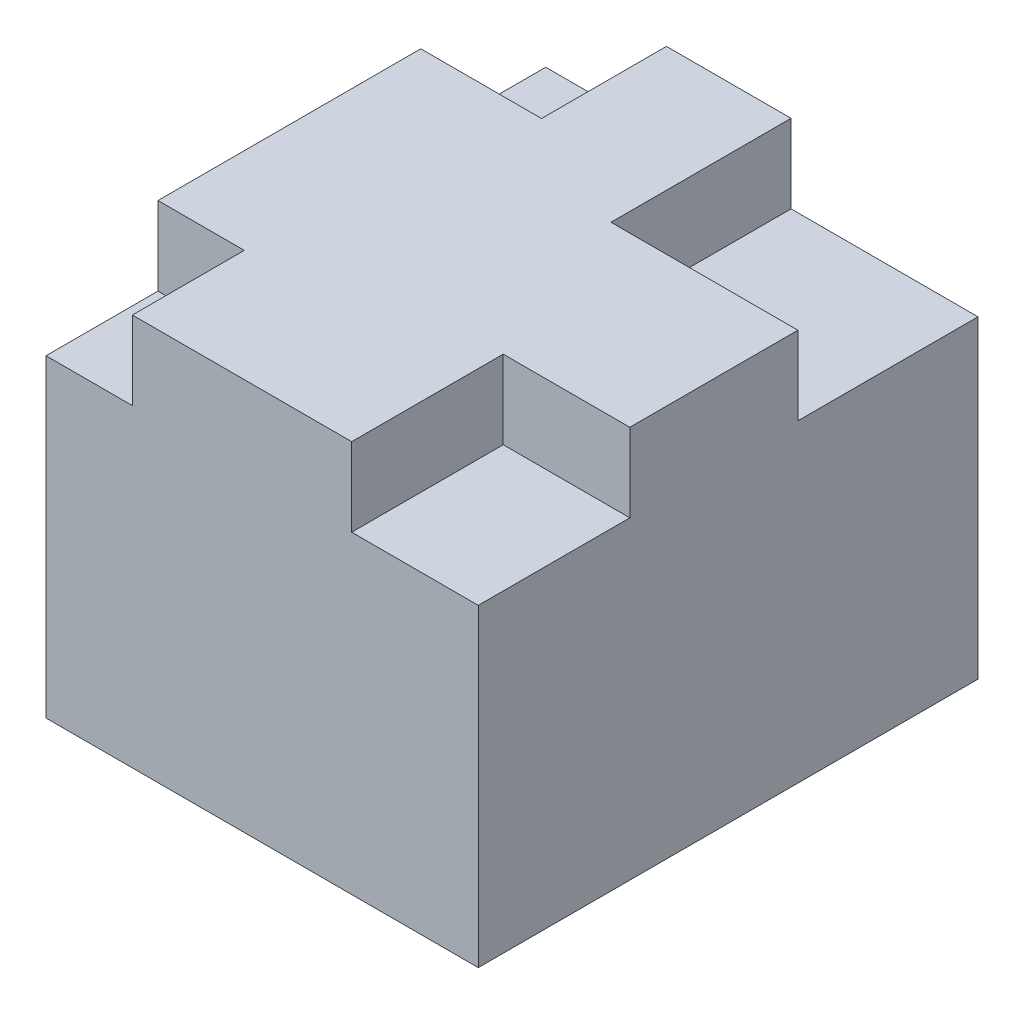
ISO-10303-21;
HEADER;
FILE_DESCRIPTION(('STEP AP214'),'2;1');
FILE_NAME('part.step','',(''),(''),'','','');
FILE_SCHEMA(('AUTOMOTIVE_DESIGN { 1 0 10303 214 1 1 1 1 }'));
ENDSEC;
DATA;
#1=APPLICATION_CONTEXT('core data for automotive mechanical design processes');
#2=APPLICATION_PROTOCOL_DEFINITION('international standard','automotive_design',2000,#1);
#3=PRODUCT_CONTEXT('',#1,'mechanical');
#4=PRODUCT('Part','Part','',(#3));
#5=PRODUCT_RELATED_PRODUCT_CATEGORY('part','',(#4));
#6=PRODUCT_DEFINITION_FORMATION('','',#4);
#7=PRODUCT_DEFINITION_CONTEXT('part definition',#1,'design');
#8=PRODUCT_DEFINITION('design','',#6,#7);
#9=PRODUCT_DEFINITION_SHAPE('','',#8);
#10=(LENGTH_UNIT() NAMED_UNIT(*) SI_UNIT(.MILLI.,.METRE.));
#11=(NAMED_UNIT(*) PLANE_ANGLE_UNIT() SI_UNIT($,.RADIAN.));
#12=(NAMED_UNIT(*) SI_UNIT($,.STERADIAN.) SOLID_ANGLE_UNIT());
#13=UNCERTAINTY_MEASURE_WITH_UNIT(LENGTH_MEASURE(1.E-05),#10,'distance_accuracy_value','');
#14=(GEOMETRIC_REPRESENTATION_CONTEXT(3) GLOBAL_UNCERTAINTY_ASSIGNED_CONTEXT((#13)) GLOBAL_UNIT_ASSIGNED_CONTEXT((#10,
#11,#12)) REPRESENTATION_CONTEXT('',''));
#15=CARTESIAN_POINT('',(0.,0.,0.));
#16=DIRECTION('',(0.,0.,1.));
#17=DIRECTION('',(1.,0.,0.));
#18=AXIS2_PLACEMENT_3D('',#15,#16,#17);
#19=CARTESIAN_POINT('',(-5.51061705069056,10.,6.37022815328691));
#20=DIRECTION('',(1.,0.,0.));
#21=DIRECTION('',(0.,0.,-1.));
#22=AXIS2_PLACEMENT_3D('',#19,#20,#21);
#23=PLANE('',#22);
#24=DIRECTION('',(0.,0.,1.));
#25=VECTOR('',#24,1.);
#26=CARTESIAN_POINT('',(-5.51061705069056,10.,6.37022815328691));
#27=LINE('',#26,#25);
#28=CARTESIAN_POINT('',(-5.51061705069056,10.,-3.18491757084579));
#29=VERTEX_POINT('',#28);
#30=CARTESIAN_POINT('',(-5.51061705069056,10.,3.51581809768684));
#31=VERTEX_POINT('',#30);
#32=EDGE_CURVE('E300',#29,#31,#27,.T.);
#33=ORIENTED_EDGE('',*,*,#32,.F.);
#34=DIRECTION('',(0.,1.,0.));
#35=VECTOR('',#34,1.);
#36=CARTESIAN_POINT('',(-5.51061705069056,8.,-3.1849175708458));
#37=LINE('',#36,#35);
#38=CARTESIAN_POINT('',(-5.51061705069056,8.,-3.1849175708458));
#39=VERTEX_POINT('',#38);
#40=EDGE_CURVE('E241',#39,#29,#37,.T.);
#41=ORIENTED_EDGE('',*,*,#40,.F.);
#42=DIRECTION('',(0.,0.,1.));
#43=VECTOR('',#42,1.);
#44=CARTESIAN_POINT('',(-5.51061705069056,8.,-6.37022815328691));
#45=LINE('',#44,#43);
#46=CARTESIAN_POINT('',(-5.51061705069056,8.,-6.37022815328691));
#47=VERTEX_POINT('',#46);
#48=EDGE_CURVE('E229',#47,#39,#45,.T.);
#49=ORIENTED_EDGE('',*,*,#48,.F.);
#50=DIRECTION('',(0.,-1.,0.));
#51=VECTOR('',#50,1.);
#52=CARTESIAN_POINT('',(-5.51061705069056,10.,-6.37022815328691));
#53=LINE('',#52,#51);
#54=CARTESIAN_POINT('',(-5.51061705069056,0.,-6.37022815328691));
#55=VERTEX_POINT('',#54);
#56=EDGE_CURVE('E311',#47,#55,#53,.T.);
#57=ORIENTED_EDGE('',*,*,#56,.T.);
#58=DIRECTION('',(0.,0.,1.));
#59=VECTOR('',#58,1.);
#60=CARTESIAN_POINT('',(-5.51061705069056,0.,6.37022815328691));
#61=LINE('',#60,#59);
#62=CARTESIAN_POINT('',(-5.51061705069056,0.,6.37022815328691));
#63=VERTEX_POINT('',#62);
#64=EDGE_CURVE('E296',#55,#63,#61,.T.);
#65=ORIENTED_EDGE('',*,*,#64,.T.);
#66=DIRECTION('',(0.,-1.,0.));
#67=VECTOR('',#66,1.);
#68=CARTESIAN_POINT('',(-5.51061705069056,10.,6.37022815328691));
#69=LINE('',#68,#67);
#70=CARTESIAN_POINT('',(-5.51061705069056,8.,6.37022815328691));
#71=VERTEX_POINT('',#70);
#72=EDGE_CURVE('E11',#71,#63,#69,.T.);
#73=ORIENTED_EDGE('',*,*,#72,.F.);
#74=DIRECTION('',(0.,0.,1.));
#75=VECTOR('',#74,1.);
#76=CARTESIAN_POINT('',(-5.51061705069056,8.,6.37022815328691));
#77=LINE('',#76,#75);
#78=CARTESIAN_POINT('',(-5.51061705069056,8.,3.51581809768684));
#79=VERTEX_POINT('',#78);
#80=EDGE_CURVE('E276',#79,#71,#77,.T.);
#81=ORIENTED_EDGE('',*,*,#80,.F.);
#82=DIRECTION('',(0.,1.,0.));
#83=VECTOR('',#82,1.);
#84=CARTESIAN_POINT('',(-5.51061705069056,8.,3.51581809768684));
#85=LINE('',#84,#83);
#86=EDGE_CURVE('E293',#79,#31,#85,.T.);
#87=ORIENTED_EDGE('',*,*,#86,.T.);
#88=EDGE_LOOP('',(#33,#41,#49,#57,#65,#73,#81,#87));
#89=FACE_BOUND('',#88,.T.);
#90=ADVANCED_FACE('F33',(#89),#23,.F.);
#91=CARTESIAN_POINT('',(5.51061705069055,10.,6.37022815328691));
#92=DIRECTION('',(0.,0.,-1.));
#93=DIRECTION('',(-1.,0.,0.));
#94=AXIS2_PLACEMENT_3D('',#91,#92,#93);
#95=PLANE('',#94);
#96=DIRECTION('',(1.,0.,0.));
#97=VECTOR('',#96,1.);
#98=CARTESIAN_POINT('',(5.51061705069055,8.,6.37022815328691));
#99=LINE('',#98,#97);
#100=CARTESIAN_POINT('',(2.28321363520371,8.,6.37022815328691));
#101=VERTEX_POINT('',#100);
#102=CARTESIAN_POINT('',(5.51061705069055,8.,6.37022815328691));
#103=VERTEX_POINT('',#102);
#104=EDGE_CURVE('E263',#101,#103,#99,.T.);
#105=ORIENTED_EDGE('',*,*,#104,.F.);
#106=DIRECTION('',(0.,1.,0.));
#107=VECTOR('',#106,1.);
#108=CARTESIAN_POINT('',(2.28321363520371,8.,6.37022815328691));
#109=LINE('',#108,#107);
#110=CARTESIAN_POINT('',(2.28321363520371,10.,6.37022815328691));
#111=VERTEX_POINT('',#110);
#112=EDGE_CURVE('E269',#101,#111,#109,.T.);
#113=ORIENTED_EDGE('',*,*,#112,.T.);
#114=DIRECTION('',(1.,0.,0.));
#115=VECTOR('',#114,1.);
#116=CARTESIAN_POINT('',(5.51061705069055,10.,6.37022815328691));
#117=LINE('',#116,#115);
#118=CARTESIAN_POINT('',(-3.30900526841118,10.,6.37022815328691));
#119=VERTEX_POINT('',#118);
#120=EDGE_CURVE('E302',#119,#111,#117,.T.);
#121=ORIENTED_EDGE('',*,*,#120,.F.);
#122=DIRECTION('',(0.,1.,0.));
#123=VECTOR('',#122,1.);
#124=CARTESIAN_POINT('',(-3.30900526841118,8.,6.37022815328691));
#125=LINE('',#124,#123);
#126=CARTESIAN_POINT('',(-3.30900526841118,8.,6.37022815328691));
#127=VERTEX_POINT('',#126);
#128=EDGE_CURVE('E288',#127,#119,#125,.T.);
#129=ORIENTED_EDGE('',*,*,#128,.F.);
#130=DIRECTION('',(1.,0.,0.));
#131=VECTOR('',#130,1.);
#132=CARTESIAN_POINT('',(-5.51061705069056,8.,6.37022815328691));
#133=LINE('',#132,#131);
#134=EDGE_CURVE('E278',#71,#127,#133,.T.);
#135=ORIENTED_EDGE('',*,*,#134,.F.);
#136=ORIENTED_EDGE('',*,*,#72,.T.);
#137=DIRECTION('',(1.,0.,0.));
#138=VECTOR('',#137,1.);
#139=CARTESIAN_POINT('',(5.51061705069055,0.,6.37022815328691));
#140=LINE('',#139,#138);
#141=CARTESIAN_POINT('',(5.51061705069055,0.,6.37022815328691));
#142=VERTEX_POINT('',#141);
#143=EDGE_CURVE('E314',#63,#142,#140,.T.);
#144=ORIENTED_EDGE('',*,*,#143,.T.);
#145=DIRECTION('',(0.,-1.,0.));
#146=VECTOR('',#145,1.);
#147=CARTESIAN_POINT('',(5.51061705069055,10.,6.37022815328691));
#148=LINE('',#147,#146);
#149=EDGE_CURVE('E40',#103,#142,#148,.T.);
#150=ORIENTED_EDGE('',*,*,#149,.F.);
#151=EDGE_LOOP('',(#105,#113,#121,#129,#135,#136,#144,#150));
#152=FACE_BOUND('',#151,.T.);
#153=ADVANCED_FACE('F336',(#152),#95,.F.);
#154=CARTESIAN_POINT('',(5.51061705069055,10.,6.37022815328691));
#155=DIRECTION('',(-1.,0.,0.));
#156=DIRECTION('',(0.,0.,1.));
#157=AXIS2_PLACEMENT_3D('',#154,#155,#156);
#158=PLANE('',#157);
#159=DIRECTION('',(0.,0.,-1.));
#160=VECTOR('',#159,1.);
#161=CARTESIAN_POINT('',(5.51061705069055,8.,-6.37022815328691));
#162=LINE('',#161,#160);
#163=CARTESIAN_POINT('',(5.51061705069055,8.,-1.77859033177104));
#164=VERTEX_POINT('',#163);
#165=CARTESIAN_POINT('',(5.51061705069055,8.,-6.37022815328691));
#166=VERTEX_POINT('',#165);
#167=EDGE_CURVE('E208',#164,#166,#162,.T.);
#168=ORIENTED_EDGE('',*,*,#167,.F.);
#169=DIRECTION('',(0.,1.,0.));
#170=VECTOR('',#169,1.);
#171=CARTESIAN_POINT('',(5.51061705069055,8.,-1.77859033177104));
#172=LINE('',#171,#170);
#173=CARTESIAN_POINT('',(5.51061705069055,10.,-1.77859033177104));
#174=VERTEX_POINT('',#173);
#175=EDGE_CURVE('E222',#164,#174,#172,.T.);
#176=ORIENTED_EDGE('',*,*,#175,.T.);
#177=DIRECTION('',(0.,0.,-1.));
#178=VECTOR('',#177,1.);
#179=CARTESIAN_POINT('',(5.51061705069055,10.,6.37022815328691));
#180=LINE('',#179,#178);
#181=CARTESIAN_POINT('',(5.51061705069055,10.,2.50657149082143));
#182=VERTEX_POINT('',#181);
#183=EDGE_CURVE('E306',#182,#174,#180,.T.);
#184=ORIENTED_EDGE('',*,*,#183,.F.);
#185=DIRECTION('',(0.,1.,0.));
#186=VECTOR('',#185,1.);
#187=CARTESIAN_POINT('',(5.51061705069055,8.,2.50657149082143));
#188=LINE('',#187,#186);
#189=CARTESIAN_POINT('',(5.51061705069055,8.,2.50657149082143));
#190=VERTEX_POINT('',#189);
#191=EDGE_CURVE('E265',#190,#182,#188,.T.);
#192=ORIENTED_EDGE('',*,*,#191,.F.);
#193=DIRECTION('',(0.,0.,-1.));
#194=VECTOR('',#193,1.);
#195=CARTESIAN_POINT('',(5.51061705069055,8.,6.37022815328691));
#196=LINE('',#195,#194);
#197=EDGE_CURVE('E253',#103,#190,#196,.T.);
#198=ORIENTED_EDGE('',*,*,#197,.F.);
#199=ORIENTED_EDGE('',*,*,#149,.T.);
#200=DIRECTION('',(0.,0.,-1.));
#201=VECTOR('',#200,1.);
#202=CARTESIAN_POINT('',(5.51061705069055,0.,6.37022815328691));
#203=LINE('',#202,#201);
#204=CARTESIAN_POINT('',(5.51061705069055,0.,-6.37022815328691));
#205=VERTEX_POINT('',#204);
#206=EDGE_CURVE('E317',#142,#205,#203,.T.);
#207=ORIENTED_EDGE('',*,*,#206,.T.);
#208=DIRECTION('',(0.,-1.,0.));
#209=VECTOR('',#208,1.);
#210=CARTESIAN_POINT('',(5.51061705069055,10.,-6.37022815328691));
#211=LINE('',#210,#209);
#212=EDGE_CURVE('E323',#166,#205,#211,.T.);
#213=ORIENTED_EDGE('',*,*,#212,.F.);
#214=EDGE_LOOP('',(#168,#176,#184,#192,#198,#199,#207,#213));
#215=FACE_BOUND('',#214,.T.);
#216=ADVANCED_FACE('F328',(#215),#158,.F.);
#217=CARTESIAN_POINT('',(5.51061705069055,10.,-6.37022815328691));
#218=DIRECTION('',(0.,0.,1.));
#219=DIRECTION('',(1.,0.,0.));
#220=AXIS2_PLACEMENT_3D('',#217,#218,#219);
#221=PLANE('',#220);
#222=DIRECTION('',(-1.,0.,0.));
#223=VECTOR('',#222,1.);
#224=CARTESIAN_POINT('',(5.51061705069055,10.,-6.37022815328691));
#225=LINE('',#224,#223);
#226=CARTESIAN_POINT('',(0.744526185392516,10.,-6.37022815328691));
#227=VERTEX_POINT('',#226);
#228=CARTESIAN_POINT('',(-2.43211887228222,10.,-6.37022815328691));
#229=VERTEX_POINT('',#228);
#230=EDGE_CURVE('E309',#227,#229,#225,.T.);
#231=ORIENTED_EDGE('',*,*,#230,.F.);
#232=DIRECTION('',(0.,1.,0.));
#233=VECTOR('',#232,1.);
#234=CARTESIAN_POINT('',(0.744526185392516,8.,-6.37022815328691));
#235=LINE('',#234,#233);
#236=CARTESIAN_POINT('',(0.744526185392516,8.,-6.37022815328691));
#237=VERTEX_POINT('',#236);
#238=EDGE_CURVE('E55',#237,#227,#235,.T.);
#239=ORIENTED_EDGE('',*,*,#238,.F.);
#240=DIRECTION('',(-1.,0.,0.));
#241=VECTOR('',#240,1.);
#242=CARTESIAN_POINT('',(5.51061705069055,8.,-6.37022815328691));
#243=LINE('',#242,#241);
#244=EDGE_CURVE('E210',#166,#237,#243,.T.);
#245=ORIENTED_EDGE('',*,*,#244,.F.);
#246=ORIENTED_EDGE('',*,*,#212,.T.);
#247=DIRECTION('',(-1.,0.,0.));
#248=VECTOR('',#247,1.);
#249=CARTESIAN_POINT('',(5.51061705069055,0.,-6.37022815328691));
#250=LINE('',#249,#248);
#251=EDGE_CURVE('E303',#205,#55,#250,.T.);
#252=ORIENTED_EDGE('',*,*,#251,.T.);
#253=ORIENTED_EDGE('',*,*,#56,.F.);
#254=DIRECTION('',(-1.,0.,0.));
#255=VECTOR('',#254,1.);
#256=CARTESIAN_POINT('',(-5.51061705069056,8.,-6.37022815328691));
#257=LINE('',#256,#255);
#258=CARTESIAN_POINT('',(-2.43211887228222,8.,-6.37022815328691));
#259=VERTEX_POINT('',#258);
#260=EDGE_CURVE('E239',#259,#47,#257,.T.);
#261=ORIENTED_EDGE('',*,*,#260,.F.);
#262=DIRECTION('',(0.,1.,0.));
#263=VECTOR('',#262,1.);
#264=CARTESIAN_POINT('',(-2.43211887228222,8.,-6.37022815328691));
#265=LINE('',#264,#263);
#266=EDGE_CURVE('E246',#259,#229,#265,.T.);
#267=ORIENTED_EDGE('',*,*,#266,.T.);
#268=EDGE_LOOP('',(#231,#239,#245,#246,#252,#253,#261,#267));
#269=FACE_BOUND('',#268,.T.);
#270=ADVANCED_FACE('F345',(#269),#221,.F.);
#271=CARTESIAN_POINT('',(0.,10.,0.));
#272=DIRECTION('',(0.,1.,0.));
#273=DIRECTION('',(0.,0.,1.));
#274=AXIS2_PLACEMENT_3D('',#271,#272,#273);
#275=PLANE('',#274);
#276=DIRECTION('',(1.,0.,0.));
#277=VECTOR('',#276,1.);
#278=CARTESIAN_POINT('',(5.51061705069055,10.,-1.77859033177104));
#279=LINE('',#278,#277);
#280=CARTESIAN_POINT('',(0.744526185392516,10.,-1.77859033177104));
#281=VERTEX_POINT('',#280);
#282=EDGE_CURVE('E211',#281,#174,#279,.T.);
#283=ORIENTED_EDGE('',*,*,#282,.F.);
#284=DIRECTION('',(0.,0.,1.));
#285=VECTOR('',#284,1.);
#286=CARTESIAN_POINT('',(0.744526185392516,10.,-6.37022815328691));
#287=LINE('',#286,#285);
#288=EDGE_CURVE('E204',#227,#281,#287,.T.);
#289=ORIENTED_EDGE('',*,*,#288,.F.);
#290=ORIENTED_EDGE('',*,*,#230,.T.);
#291=DIRECTION('',(0.,0.,-1.));
#292=VECTOR('',#291,1.);
#293=CARTESIAN_POINT('',(-2.43211887228222,10.,-6.37022815328691));
#294=LINE('',#293,#292);
#295=CARTESIAN_POINT('',(-2.43211887228222,10.,-3.1849175708458));
#296=VERTEX_POINT('',#295);
#297=EDGE_CURVE('E233',#296,#229,#294,.T.);
#298=ORIENTED_EDGE('',*,*,#297,.F.);
#299=DIRECTION('',(1.,0.,0.));
#300=VECTOR('',#299,1.);
#301=CARTESIAN_POINT('',(-5.51061705069056,10.,-3.1849175708458));
#302=LINE('',#301,#300);
#303=EDGE_CURVE('E225',#29,#296,#302,.T.);
#304=ORIENTED_EDGE('',*,*,#303,.F.);
#305=ORIENTED_EDGE('',*,*,#32,.T.);
#306=DIRECTION('',(-1.,0.,0.));
#307=VECTOR('',#306,1.);
#308=CARTESIAN_POINT('',(-5.51061705069056,10.,3.51581809768684));
#309=LINE('',#308,#307);
#310=CARTESIAN_POINT('',(-3.30900526841118,10.,3.51581809768684));
#311=VERTEX_POINT('',#310);
#312=EDGE_CURVE('E279',#311,#31,#309,.T.);
#313=ORIENTED_EDGE('',*,*,#312,.F.);
#314=DIRECTION('',(0.,0.,-1.));
#315=VECTOR('',#314,1.);
#316=CARTESIAN_POINT('',(-3.30900526841118,10.,6.37022815328691));
#317=LINE('',#316,#315);
#318=EDGE_CURVE('E272',#119,#311,#317,.T.);
#319=ORIENTED_EDGE('',*,*,#318,.F.);
#320=ORIENTED_EDGE('',*,*,#120,.T.);
#321=DIRECTION('',(0.,0.,1.));
#322=VECTOR('',#321,1.);
#323=CARTESIAN_POINT('',(2.28321363520371,10.,6.37022815328691));
#324=LINE('',#323,#322);
#325=CARTESIAN_POINT('',(2.28321363520371,10.,2.50657149082143));
#326=VERTEX_POINT('',#325);
#327=EDGE_CURVE('E257',#326,#111,#324,.T.);
#328=ORIENTED_EDGE('',*,*,#327,.F.);
#329=DIRECTION('',(-1.,0.,0.));
#330=VECTOR('',#329,1.);
#331=CARTESIAN_POINT('',(5.51061705069055,10.,2.50657149082143));
#332=LINE('',#331,#330);
#333=EDGE_CURVE('E249',#182,#326,#332,.T.);
#334=ORIENTED_EDGE('',*,*,#333,.F.);
#335=ORIENTED_EDGE('',*,*,#183,.T.);
#336=EDGE_LOOP('',(#283,#289,#290,#298,#304,#305,#313,#319,#320,#328,#334,#335));
#337=FACE_BOUND('',#336,.T.);
#338=ADVANCED_FACE('F356',(#337),#275,.T.);
#339=CARTESIAN_POINT('',(0.,0.,0.));
#340=DIRECTION('',(0.,1.,0.));
#341=DIRECTION('',(0.,0.,1.));
#342=AXIS2_PLACEMENT_3D('',#339,#340,#341);
#343=PLANE('',#342);
#344=DIRECTION('',(1.,0.,0.));
#345=VECTOR('',#344,1.);
#346=CARTESIAN_POINT('',(2.1012183454411,0.,-2.17567096398038));
#347=LINE('',#346,#345);
#348=CARTESIAN_POINT('',(-2.1012183454411,0.,-2.17567096398038));
#349=VERTEX_POINT('',#348);
#350=CARTESIAN_POINT('',(2.1012183454411,0.,-2.17567096398038));
#351=VERTEX_POINT('',#350);
#352=EDGE_CURVE('E198',#349,#351,#347,.T.);
#353=ORIENTED_EDGE('',*,*,#352,.F.);
#354=DIRECTION('',(0.,0.,-1.));
#355=VECTOR('',#354,1.);
#356=CARTESIAN_POINT('',(-2.1012183454411,0.,-2.17567096398038));
#357=LINE('',#356,#355);
#358=CARTESIAN_POINT('',(-2.1012183454411,0.,2.17567096398038));
#359=VERTEX_POINT('',#358);
#360=EDGE_CURVE('E47',#359,#349,#357,.T.);
#361=ORIENTED_EDGE('',*,*,#360,.F.);
#362=DIRECTION('',(-1.,0.,0.));
#363=VECTOR('',#362,1.);
#364=CARTESIAN_POINT('',(2.1012183454411,0.,2.17567096398038));
#365=LINE('',#364,#363);
#366=CARTESIAN_POINT('',(2.1012183454411,0.,2.17567096398038));
#367=VERTEX_POINT('',#366);
#368=EDGE_CURVE('E189',#367,#359,#365,.T.);
#369=ORIENTED_EDGE('',*,*,#368,.F.);
#370=DIRECTION('',(0.,0.,1.));
#371=VECTOR('',#370,1.);
#372=CARTESIAN_POINT('',(2.1012183454411,0.,-2.17567096398038));
#373=LINE('',#372,#371);
#374=EDGE_CURVE('E192',#351,#367,#373,.T.);
#375=ORIENTED_EDGE('',*,*,#374,.F.);
#376=EDGE_LOOP('',(#353,#361,#369,#375));
#377=FACE_BOUND('',#376,.T.);
#378=ORIENTED_EDGE('',*,*,#64,.F.);
#379=ORIENTED_EDGE('',*,*,#251,.F.);
#380=ORIENTED_EDGE('',*,*,#206,.F.);
#381=ORIENTED_EDGE('',*,*,#143,.F.);
#382=EDGE_LOOP('',(#378,#379,#380,#381));
#383=FACE_BOUND('',#382,.T.);
#384=ADVANCED_FACE('F341',(#377,#383),#343,.F.);
#385=CARTESIAN_POINT('',(-5.51061705069056,8.,3.51581809768684));
#386=DIRECTION('',(0.,0.,-1.));
#387=DIRECTION('',(-1.,0.,0.));
#388=AXIS2_PLACEMENT_3D('',#385,#386,#387);
#389=PLANE('',#388);
#390=ORIENTED_EDGE('',*,*,#312,.T.);
#391=ORIENTED_EDGE('',*,*,#86,.F.);
#392=DIRECTION('',(-1.,0.,0.));
#393=VECTOR('',#392,1.);
#394=CARTESIAN_POINT('',(-5.51061705069056,8.,3.51581809768684));
#395=LINE('',#394,#393);
#396=CARTESIAN_POINT('',(-3.30900526841118,8.,3.51581809768684));
#397=VERTEX_POINT('',#396);
#398=EDGE_CURVE('E285',#397,#79,#395,.T.);
#399=ORIENTED_EDGE('',*,*,#398,.F.);
#400=DIRECTION('',(0.,1.,0.));
#401=VECTOR('',#400,1.);
#402=CARTESIAN_POINT('',(-3.30900526841118,8.,3.51581809768684));
#403=LINE('',#402,#401);
#404=EDGE_CURVE('E297',#397,#311,#403,.T.);
#405=ORIENTED_EDGE('',*,*,#404,.T.);
#406=EDGE_LOOP('',(#390,#391,#399,#405));
#407=FACE_BOUND('',#406,.T.);
#408=ADVANCED_FACE('F387',(#407),#389,.F.);
#409=CARTESIAN_POINT('',(-3.30900526841118,8.,6.37022815328691));
#410=DIRECTION('',(1.,0.,0.));
#411=DIRECTION('',(0.,0.,-1.));
#412=AXIS2_PLACEMENT_3D('',#409,#410,#411);
#413=PLANE('',#412);
#414=ORIENTED_EDGE('',*,*,#318,.T.);
#415=ORIENTED_EDGE('',*,*,#404,.F.);
#416=DIRECTION('',(0.,0.,-1.));
#417=VECTOR('',#416,1.);
#418=CARTESIAN_POINT('',(-3.30900526841118,8.,6.37022815328691));
#419=LINE('',#418,#417);
#420=EDGE_CURVE('E282',#127,#397,#419,.T.);
#421=ORIENTED_EDGE('',*,*,#420,.F.);
#422=ORIENTED_EDGE('',*,*,#128,.T.);
#423=EDGE_LOOP('',(#414,#415,#421,#422));
#424=FACE_BOUND('',#423,.T.);
#425=ADVANCED_FACE('F370',(#424),#413,.F.);
#426=CARTESIAN_POINT('',(0.,8.,0.));
#427=DIRECTION('',(0.,-1.,0.));
#428=DIRECTION('',(0.,0.,-1.));
#429=AXIS2_PLACEMENT_3D('',#426,#427,#428);
#430=PLANE('',#429);
#431=ORIENTED_EDGE('',*,*,#80,.T.);
#432=ORIENTED_EDGE('',*,*,#134,.T.);
#433=ORIENTED_EDGE('',*,*,#420,.T.);
#434=ORIENTED_EDGE('',*,*,#398,.T.);
#435=EDGE_LOOP('',(#431,#432,#433,#434));
#436=FACE_BOUND('',#435,.T.);
#437=ADVANCED_FACE('F388',(#436),#430,.F.);
#438=CARTESIAN_POINT('',(2.28321363520371,8.,6.37022815328691));
#439=DIRECTION('',(-1.,0.,0.));
#440=DIRECTION('',(0.,0.,1.));
#441=AXIS2_PLACEMENT_3D('',#438,#439,#440);
#442=PLANE('',#441);
#443=ORIENTED_EDGE('',*,*,#327,.T.);
#444=ORIENTED_EDGE('',*,*,#112,.F.);
#445=DIRECTION('',(0.,0.,1.));
#446=VECTOR('',#445,1.);
#447=CARTESIAN_POINT('',(2.28321363520371,8.,6.37022815328691));
#448=LINE('',#447,#446);
#449=CARTESIAN_POINT('',(2.28321363520371,8.,2.50657149082143));
#450=VERTEX_POINT('',#449);
#451=EDGE_CURVE('E260',#450,#101,#448,.T.);
#452=ORIENTED_EDGE('',*,*,#451,.F.);
#453=DIRECTION('',(0.,1.,0.));
#454=VECTOR('',#453,1.);
#455=CARTESIAN_POINT('',(2.28321363520371,8.,2.50657149082143));
#456=LINE('',#455,#454);
#457=EDGE_CURVE('E273',#450,#326,#456,.T.);
#458=ORIENTED_EDGE('',*,*,#457,.T.);
#459=EDGE_LOOP('',(#443,#444,#452,#458));
#460=FACE_BOUND('',#459,.T.);
#461=ADVANCED_FACE('F390',(#460),#442,.F.);
#462=CARTESIAN_POINT('',(5.51061705069055,8.,2.50657149082143));
#463=DIRECTION('',(0.,0.,-1.));
#464=DIRECTION('',(-1.,0.,0.));
#465=AXIS2_PLACEMENT_3D('',#462,#463,#464);
#466=PLANE('',#465);
#467=ORIENTED_EDGE('',*,*,#333,.T.);
#468=ORIENTED_EDGE('',*,*,#457,.F.);
#469=DIRECTION('',(-1.,0.,0.));
#470=VECTOR('',#469,1.);
#471=CARTESIAN_POINT('',(5.51061705069055,8.,2.50657149082143));
#472=LINE('',#471,#470);
#473=EDGE_CURVE('E256',#190,#450,#472,.T.);
#474=ORIENTED_EDGE('',*,*,#473,.F.);
#475=ORIENTED_EDGE('',*,*,#191,.T.);
#476=EDGE_LOOP('',(#467,#468,#474,#475));
#477=FACE_BOUND('',#476,.T.);
#478=ADVANCED_FACE('F360',(#477),#466,.F.);
#479=CARTESIAN_POINT('',(0.,8.,0.));
#480=DIRECTION('',(0.,1.,0.));
#481=DIRECTION('',(0.,0.,1.));
#482=AXIS2_PLACEMENT_3D('',#479,#480,#481);
#483=PLANE('',#482);
#484=ORIENTED_EDGE('',*,*,#197,.T.);
#485=ORIENTED_EDGE('',*,*,#473,.T.);
#486=ORIENTED_EDGE('',*,*,#451,.T.);
#487=ORIENTED_EDGE('',*,*,#104,.T.);
#488=EDGE_LOOP('',(#484,#485,#486,#487));
#489=FACE_BOUND('',#488,.T.);
#490=ADVANCED_FACE('F363',(#489),#483,.T.);
#491=CARTESIAN_POINT('',(-2.43211887228222,8.,-6.37022815328691));
#492=DIRECTION('',(1.,0.,0.));
#493=DIRECTION('',(0.,0.,-1.));
#494=AXIS2_PLACEMENT_3D('',#491,#492,#493);
#495=PLANE('',#494);
#496=ORIENTED_EDGE('',*,*,#297,.T.);
#497=ORIENTED_EDGE('',*,*,#266,.F.);
#498=DIRECTION('',(0.,0.,-1.));
#499=VECTOR('',#498,1.);
#500=CARTESIAN_POINT('',(-2.43211887228222,8.,-6.37022815328691));
#501=LINE('',#500,#499);
#502=CARTESIAN_POINT('',(-2.43211887228222,8.,-3.1849175708458));
#503=VERTEX_POINT('',#502);
#504=EDGE_CURVE('E236',#503,#259,#501,.T.);
#505=ORIENTED_EDGE('',*,*,#504,.F.);
#506=DIRECTION('',(0.,1.,0.));
#507=VECTOR('',#506,1.);
#508=CARTESIAN_POINT('',(-2.43211887228222,8.,-3.1849175708458));
#509=LINE('',#508,#507);
#510=EDGE_CURVE('E250',#503,#296,#509,.T.);
#511=ORIENTED_EDGE('',*,*,#510,.T.);
#512=EDGE_LOOP('',(#496,#497,#505,#511));
#513=FACE_BOUND('',#512,.T.);
#514=ADVANCED_FACE('F381',(#513),#495,.F.);
#515=CARTESIAN_POINT('',(-5.51061705069056,8.,-3.1849175708458));
#516=DIRECTION('',(0.,0.,1.));
#517=DIRECTION('',(1.,0.,0.));
#518=AXIS2_PLACEMENT_3D('',#515,#516,#517);
#519=PLANE('',#518);
#520=ORIENTED_EDGE('',*,*,#303,.T.);
#521=ORIENTED_EDGE('',*,*,#510,.F.);
#522=DIRECTION('',(1.,0.,0.));
#523=VECTOR('',#522,1.);
#524=CARTESIAN_POINT('',(-5.51061705069056,8.,-3.1849175708458));
#525=LINE('',#524,#523);
#526=EDGE_CURVE('E232',#39,#503,#525,.T.);
#527=ORIENTED_EDGE('',*,*,#526,.F.);
#528=ORIENTED_EDGE('',*,*,#40,.T.);
#529=EDGE_LOOP('',(#520,#521,#527,#528));
#530=FACE_BOUND('',#529,.T.);
#531=ADVANCED_FACE('F459',(#530),#519,.F.);
#532=CARTESIAN_POINT('',(0.,8.,0.));
#533=DIRECTION('',(0.,1.,0.));
#534=DIRECTION('',(0.,0.,1.));
#535=AXIS2_PLACEMENT_3D('',#532,#533,#534);
#536=PLANE('',#535);
#537=ORIENTED_EDGE('',*,*,#48,.T.);
#538=ORIENTED_EDGE('',*,*,#526,.T.);
#539=ORIENTED_EDGE('',*,*,#504,.T.);
#540=ORIENTED_EDGE('',*,*,#260,.T.);
#541=EDGE_LOOP('',(#537,#538,#539,#540));
#542=FACE_BOUND('',#541,.T.);
#543=ADVANCED_FACE('F378',(#542),#536,.T.);
#544=CARTESIAN_POINT('',(5.51061705069055,8.,-1.77859033177104));
#545=DIRECTION('',(0.,0.,1.));
#546=DIRECTION('',(1.,0.,0.));
#547=AXIS2_PLACEMENT_3D('',#544,#545,#546);
#548=PLANE('',#547);
#549=ORIENTED_EDGE('',*,*,#282,.T.);
#550=ORIENTED_EDGE('',*,*,#175,.F.);
#551=DIRECTION('',(1.,0.,0.));
#552=VECTOR('',#551,1.);
#553=CARTESIAN_POINT('',(5.51061705069055,8.,-1.77859033177104));
#554=LINE('',#553,#552);
#555=CARTESIAN_POINT('',(0.744526185392516,8.,-1.77859033177104));
#556=VERTEX_POINT('',#555);
#557=EDGE_CURVE('E217',#556,#164,#554,.T.);
#558=ORIENTED_EDGE('',*,*,#557,.F.);
#559=DIRECTION('',(0.,1.,0.));
#560=VECTOR('',#559,1.);
#561=CARTESIAN_POINT('',(0.744526185392516,8.,-1.77859033177104));
#562=LINE('',#561,#560);
#563=EDGE_CURVE('E226',#556,#281,#562,.T.);
#564=ORIENTED_EDGE('',*,*,#563,.T.);
#565=EDGE_LOOP('',(#549,#550,#558,#564));
#566=FACE_BOUND('',#565,.T.);
#567=ADVANCED_FACE('F353',(#566),#548,.F.);
#568=CARTESIAN_POINT('',(0.744526185392516,8.,-6.37022815328691));
#569=DIRECTION('',(-1.,0.,0.));
#570=DIRECTION('',(0.,0.,1.));
#571=AXIS2_PLACEMENT_3D('',#568,#569,#570);
#572=PLANE('',#571);
#573=ORIENTED_EDGE('',*,*,#288,.T.);
#574=ORIENTED_EDGE('',*,*,#563,.F.);
#575=DIRECTION('',(0.,0.,1.));
#576=VECTOR('',#575,1.);
#577=CARTESIAN_POINT('',(0.744526185392516,8.,-6.37022815328691));
#578=LINE('',#577,#576);
#579=EDGE_CURVE('E214',#237,#556,#578,.T.);
#580=ORIENTED_EDGE('',*,*,#579,.F.);
#581=ORIENTED_EDGE('',*,*,#238,.T.);
#582=EDGE_LOOP('',(#573,#574,#580,#581));
#583=FACE_BOUND('',#582,.T.);
#584=ADVANCED_FACE('F484',(#583),#572,.F.);
#585=CARTESIAN_POINT('',(0.,8.,0.));
#586=DIRECTION('',(0.,-1.,0.));
#587=DIRECTION('',(0.,0.,-1.));
#588=AXIS2_PLACEMENT_3D('',#585,#586,#587);
#589=PLANE('',#588);
#590=ORIENTED_EDGE('',*,*,#167,.T.);
#591=ORIENTED_EDGE('',*,*,#244,.T.);
#592=ORIENTED_EDGE('',*,*,#579,.T.);
#593=ORIENTED_EDGE('',*,*,#557,.T.);
#594=EDGE_LOOP('',(#590,#591,#592,#593));
#595=FACE_BOUND('',#594,.T.);
#596=ADVANCED_FACE('F350',(#595),#589,.F.);
#597=CARTESIAN_POINT('',(-2.1012183454411,5.,-2.17567096398038));
#598=DIRECTION('',(-1.,0.,0.));
#599=DIRECTION('',(0.,0.,1.));
#600=AXIS2_PLACEMENT_3D('',#597,#598,#599);
#601=PLANE('',#600);
#602=ORIENTED_EDGE('',*,*,#360,.T.);
#603=DIRECTION('',(0.,-1.,0.));
#604=VECTOR('',#603,1.);
#605=CARTESIAN_POINT('',(-2.1012183454411,5.,-2.17567096398038));
#606=LINE('',#605,#604);
#607=CARTESIAN_POINT('',(-2.1012183454411,5.,-2.17567096398038));
#608=VERTEX_POINT('',#607);
#609=EDGE_CURVE('E167',#608,#349,#606,.T.);
#610=ORIENTED_EDGE('',*,*,#609,.F.);
#611=DIRECTION('',(0.,0.,-1.));
#612=VECTOR('',#611,1.);
#613=CARTESIAN_POINT('',(-2.1012183454411,5.,-2.17567096398038));
#614=LINE('',#613,#612);
#615=CARTESIAN_POINT('',(-2.1012183454411,5.,2.17567096398038));
#616=VERTEX_POINT('',#615);
#617=EDGE_CURVE('E171',#616,#608,#614,.T.);
#618=ORIENTED_EDGE('',*,*,#617,.F.);
#619=DIRECTION('',(0.,-1.,0.));
#620=VECTOR('',#619,1.);
#621=CARTESIAN_POINT('',(-2.1012183454411,5.,2.17567096398038));
#622=LINE('',#621,#620);
#623=EDGE_CURVE('E202',#616,#359,#622,.T.);
#624=ORIENTED_EDGE('',*,*,#623,.T.);
#625=EDGE_LOOP('',(#602,#610,#618,#624));
#626=FACE_BOUND('',#625,.T.);
#627=ADVANCED_FACE('F169',(#626),#601,.F.);
#628=CARTESIAN_POINT('',(2.1012183454411,5.,2.17567096398038));
#629=DIRECTION('',(0.,0.,1.));
#630=DIRECTION('',(1.,0.,0.));
#631=AXIS2_PLACEMENT_3D('',#628,#629,#630);
#632=PLANE('',#631);
#633=ORIENTED_EDGE('',*,*,#368,.T.);
#634=ORIENTED_EDGE('',*,*,#623,.F.);
#635=DIRECTION('',(-1.,0.,0.));
#636=VECTOR('',#635,1.);
#637=CARTESIAN_POINT('',(2.1012183454411,5.,2.17567096398038));
#638=LINE('',#637,#636);
#639=CARTESIAN_POINT('',(2.1012183454411,5.,2.17567096398038));
#640=VERTEX_POINT('',#639);
#641=EDGE_CURVE('E177',#640,#616,#638,.T.);
#642=ORIENTED_EDGE('',*,*,#641,.F.);
#643=DIRECTION('',(0.,-1.,0.));
#644=VECTOR('',#643,1.);
#645=CARTESIAN_POINT('',(2.1012183454411,5.,2.17567096398038));
#646=LINE('',#645,#644);
#647=EDGE_CURVE('E205',#640,#367,#646,.T.);
#648=ORIENTED_EDGE('',*,*,#647,.T.);
#649=EDGE_LOOP('',(#633,#634,#642,#648));
#650=FACE_BOUND('',#649,.T.);
#651=ADVANCED_FACE('F514',(#650),#632,.F.);
#652=CARTESIAN_POINT('',(2.1012183454411,5.,-2.17567096398038));
#653=DIRECTION('',(1.,0.,0.));
#654=DIRECTION('',(0.,0.,-1.));
#655=AXIS2_PLACEMENT_3D('',#652,#653,#654);
#656=PLANE('',#655);
#657=ORIENTED_EDGE('',*,*,#374,.T.);
#658=ORIENTED_EDGE('',*,*,#647,.F.);
#659=DIRECTION('',(0.,0.,1.));
#660=VECTOR('',#659,1.);
#661=CARTESIAN_POINT('',(2.1012183454411,5.,-2.17567096398038));
#662=LINE('',#661,#660);
#663=CARTESIAN_POINT('',(2.1012183454411,5.,-2.17567096398038));
#664=VERTEX_POINT('',#663);
#665=EDGE_CURVE('E185',#664,#640,#662,.T.);
#666=ORIENTED_EDGE('',*,*,#665,.F.);
#667=DIRECTION('',(0.,-1.,0.));
#668=VECTOR('',#667,1.);
#669=CARTESIAN_POINT('',(2.1012183454411,5.,-2.17567096398038));
#670=LINE('',#669,#668);
#671=EDGE_CURVE('E176',#664,#351,#670,.T.);
#672=ORIENTED_EDGE('',*,*,#671,.T.);
#673=EDGE_LOOP('',(#657,#658,#666,#672));
#674=FACE_BOUND('',#673,.T.);
#675=ADVANCED_FACE('F523',(#674),#656,.F.);
#676=CARTESIAN_POINT('',(2.1012183454411,5.,-2.17567096398038));
#677=DIRECTION('',(0.,0.,-1.));
#678=DIRECTION('',(-1.,0.,0.));
#679=AXIS2_PLACEMENT_3D('',#676,#677,#678);
#680=PLANE('',#679);
#681=ORIENTED_EDGE('',*,*,#352,.T.);
#682=ORIENTED_EDGE('',*,*,#671,.F.);
#683=DIRECTION('',(1.,0.,0.));
#684=VECTOR('',#683,1.);
#685=CARTESIAN_POINT('',(2.1012183454411,5.,-2.17567096398038));
#686=LINE('',#685,#684);
#687=EDGE_CURVE('E180',#608,#664,#686,.T.);
#688=ORIENTED_EDGE('',*,*,#687,.F.);
#689=ORIENTED_EDGE('',*,*,#609,.T.);
#690=EDGE_LOOP('',(#681,#682,#688,#689));
#691=FACE_BOUND('',#690,.T.);
#692=ADVANCED_FACE('F181',(#691),#680,.F.);
#693=CARTESIAN_POINT('',(0.,5.,0.));
#694=DIRECTION('',(0.,-1.,0.));
#695=DIRECTION('',(0.,0.,-1.));
#696=AXIS2_PLACEMENT_3D('',#693,#694,#695);
#697=PLANE('',#696);
#698=ORIENTED_EDGE('',*,*,#617,.T.);
#699=ORIENTED_EDGE('',*,*,#687,.T.);
#700=ORIENTED_EDGE('',*,*,#665,.T.);
#701=ORIENTED_EDGE('',*,*,#641,.T.);
#702=EDGE_LOOP('',(#698,#699,#700,#701));
#703=FACE_BOUND('',#702,.T.);
#704=ADVANCED_FACE('F187',(#703),#697,.T.);
#705=CLOSED_SHELL('',(#90,#153,#216,#270,#338,#384,#408,#425,#437,#461,#478,#490,#514,#531,#543,
#567,#584,#596,#627,#651,#675,#692,#704));
#706=MANIFOLD_SOLID_BREP('B2',#705);
#707=ADVANCED_BREP_SHAPE_REPRESENTATION('',(#18,#706),#14);
#708=SHAPE_DEFINITION_REPRESENTATION(#9,#707);
ENDSEC;
END-ISO-10303-21;
